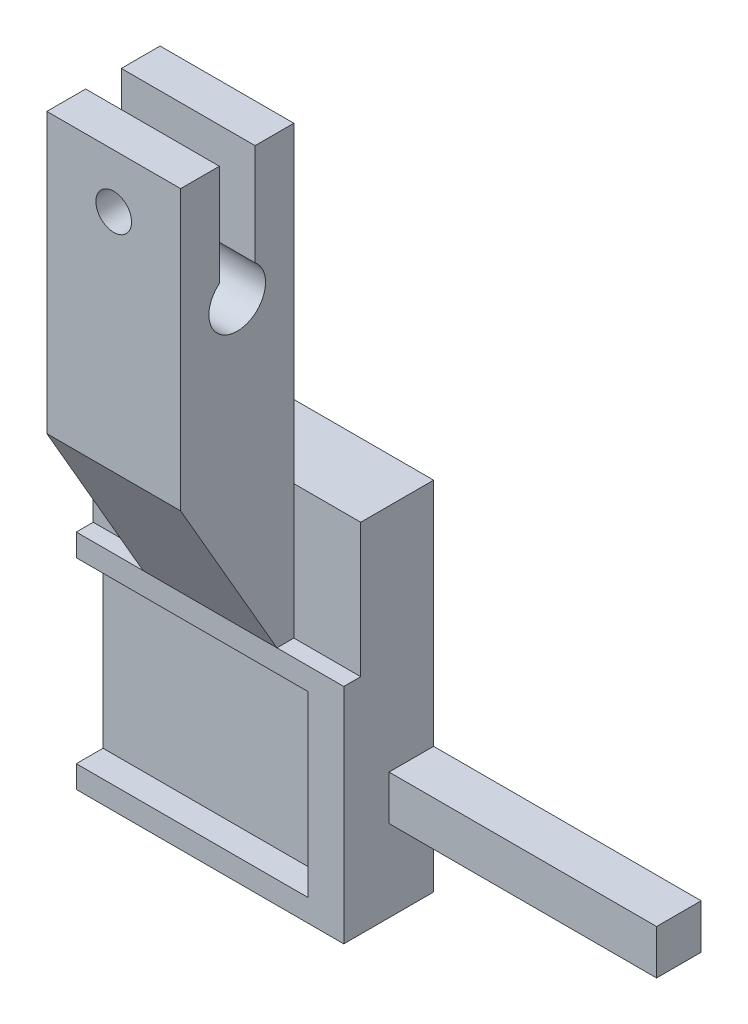
ISO-10303-21;
HEADER;
FILE_DESCRIPTION(('STEP AP214'),'2;1');
FILE_NAME('part.step','',(''),(''),'','','');
FILE_SCHEMA(('AUTOMOTIVE_DESIGN { 1 0 10303 214 1 1 1 1 }'));
ENDSEC;
DATA;
#1=APPLICATION_CONTEXT('core data for automotive mechanical design processes');
#2=APPLICATION_PROTOCOL_DEFINITION('international standard','automotive_design',2000,#1);
#3=PRODUCT_CONTEXT('',#1,'mechanical');
#4=PRODUCT('Part','Part','',(#3));
#5=PRODUCT_RELATED_PRODUCT_CATEGORY('part','',(#4));
#6=PRODUCT_DEFINITION_FORMATION('','',#4);
#7=PRODUCT_DEFINITION_CONTEXT('part definition',#1,'design');
#8=PRODUCT_DEFINITION('design','',#6,#7);
#9=PRODUCT_DEFINITION_SHAPE('','',#8);
#10=(LENGTH_UNIT() NAMED_UNIT(*) SI_UNIT(.MILLI.,.METRE.));
#11=(NAMED_UNIT(*) PLANE_ANGLE_UNIT() SI_UNIT($,.RADIAN.));
#12=(NAMED_UNIT(*) SI_UNIT($,.STERADIAN.) SOLID_ANGLE_UNIT());
#13=UNCERTAINTY_MEASURE_WITH_UNIT(LENGTH_MEASURE(1.E-05),#10,'distance_accuracy_value','');
#14=(GEOMETRIC_REPRESENTATION_CONTEXT(3) GLOBAL_UNCERTAINTY_ASSIGNED_CONTEXT((#13)) GLOBAL_UNIT_ASSIGNED_CONTEXT((#10,
#11,#12)) REPRESENTATION_CONTEXT('',''));
#15=CARTESIAN_POINT('',(0.,0.,0.));
#16=DIRECTION('',(0.,0.,1.));
#17=DIRECTION('',(1.,0.,0.));
#18=AXIS2_PLACEMENT_3D('',#15,#16,#17);
#19=CARTESIAN_POINT('',(15.,25.,8.17500000000001));
#20=DIRECTION('',(0.,0.,-1.));
#21=DIRECTION('',(0.,1.,0.));
#22=AXIS2_PLACEMENT_3D('',#19,#20,#21);
#23=PLANE('',#22);
#24=DIRECTION('',(0.,-1.,0.));
#25=VECTOR('',#24,1.);
#26=CARTESIAN_POINT('',(-7.5,40.,8.17500000000001));
#27=LINE('',#26,#25);
#28=CARTESIAN_POINT('',(-7.5,40.,8.17500000000001));
#29=VERTEX_POINT('',#28);
#30=CARTESIAN_POINT('',(-7.5,25.,8.175));
#31=VERTEX_POINT('',#30);
#32=EDGE_CURVE('E351',#29,#31,#27,.T.);
#33=ORIENTED_EDGE('',*,*,#32,.T.);
#34=DIRECTION('',(1.,0.,0.));
#35=VECTOR('',#34,1.);
#36=CARTESIAN_POINT('',(15.,25.,8.17500000000001));
#37=LINE('',#36,#35);
#38=CARTESIAN_POINT('',(0.,25.,8.17500000000001));
#39=VERTEX_POINT('',#38);
#40=EDGE_CURVE('E229',#31,#39,#37,.T.);
#41=ORIENTED_EDGE('',*,*,#40,.T.);
#42=DIRECTION('',(0.,-1.,0.));
#43=VECTOR('',#42,1.);
#44=CARTESIAN_POINT('',(0.,0.,8.175));
#45=LINE('',#44,#43);
#46=CARTESIAN_POINT('',(0.,40.,8.17500000000001));
#47=VERTEX_POINT('',#46);
#48=EDGE_CURVE('E11',#47,#39,#45,.T.);
#49=ORIENTED_EDGE('',*,*,#48,.F.);
#50=DIRECTION('',(1.,0.,0.));
#51=VECTOR('',#50,1.);
#52=CARTESIAN_POINT('',(-7.5,40.,8.17500000000001));
#53=LINE('',#52,#51);
#54=EDGE_CURVE('E340',#29,#47,#53,.T.);
#55=ORIENTED_EDGE('',*,*,#54,.F.);
#56=EDGE_LOOP('',(#33,#41,#49,#55));
#57=FACE_BOUND('',#56,.T.);
#58=ADVANCED_FACE('F31',(#57),#23,.F.);
#59=DIRECTION('',(0.,-1.,0.));
#60=VECTOR('',#59,1.);
#61=CARTESIAN_POINT('',(15.,0.,8.175));
#62=LINE('',#61,#60);
#63=CARTESIAN_POINT('',(15.,40.,8.17500000000001));
#64=VERTEX_POINT('',#63);
#65=CARTESIAN_POINT('',(15.,25.,8.17500000000001));
#66=VERTEX_POINT('',#65);
#67=EDGE_CURVE('E338',#64,#66,#62,.T.);
#68=ORIENTED_EDGE('',*,*,#67,.T.);
#69=CARTESIAN_POINT('',(22.5,25.,8.175));
#70=VERTEX_POINT('',#69);
#71=EDGE_CURVE('E226',#66,#70,#37,.T.);
#72=ORIENTED_EDGE('',*,*,#71,.T.);
#73=DIRECTION('',(0.,-1.,0.));
#74=VECTOR('',#73,1.);
#75=CARTESIAN_POINT('',(22.5,40.,8.17500000000001));
#76=LINE('',#75,#74);
#77=CARTESIAN_POINT('',(22.5,40.,8.17500000000001));
#78=VERTEX_POINT('',#77);
#79=EDGE_CURVE('E253',#78,#70,#76,.T.);
#80=ORIENTED_EDGE('',*,*,#79,.F.);
#81=EDGE_CURVE('E343',#64,#78,#53,.T.);
#82=ORIENTED_EDGE('',*,*,#81,.F.);
#83=EDGE_LOOP('',(#68,#72,#80,#82));
#84=FACE_BOUND('',#83,.T.);
#85=ADVANCED_FACE('F365',(#84),#23,.F.);
#86=CARTESIAN_POINT('',(15.,75.,8.17500000000001));
#87=DIRECTION('',(0.,-1.,0.));
#88=DIRECTION('',(0.,0.,-1.));
#89=AXIS2_PLACEMENT_3D('',#86,#87,#88);
#90=PLANE('',#89);
#91=DIRECTION('',(0.,0.,1.));
#92=VECTOR('',#91,1.);
#93=CARTESIAN_POINT('',(15.,75.,8.17500000000001));
#94=LINE('',#93,#92);
#95=CARTESIAN_POINT('',(15.,75.,16.525));
#96=VERTEX_POINT('',#95);
#97=CARTESIAN_POINT('',(15.,75.,20.875));
#98=VERTEX_POINT('',#97);
#99=EDGE_CURVE('E304',#96,#98,#94,.T.);
#100=ORIENTED_EDGE('',*,*,#99,.F.);
#101=DIRECTION('',(-1.,0.,0.));
#102=VECTOR('',#101,1.);
#103=CARTESIAN_POINT('',(15.,75.,16.525));
#104=LINE('',#103,#102);
#105=CARTESIAN_POINT('',(0.,75.,16.525));
#106=VERTEX_POINT('',#105);
#107=EDGE_CURVE('E299',#96,#106,#104,.T.);
#108=ORIENTED_EDGE('',*,*,#107,.T.);
#109=DIRECTION('',(0.,0.,1.));
#110=VECTOR('',#109,1.);
#111=CARTESIAN_POINT('',(0.,75.,8.17500000000001));
#112=LINE('',#111,#110);
#113=CARTESIAN_POINT('',(0.,75.,20.875));
#114=VERTEX_POINT('',#113);
#115=EDGE_CURVE('E296',#106,#114,#112,.T.);
#116=ORIENTED_EDGE('',*,*,#115,.T.);
#117=DIRECTION('',(-1.,0.,0.));
#118=VECTOR('',#117,1.);
#119=CARTESIAN_POINT('',(15.,75.,20.875));
#120=LINE('',#119,#118);
#121=EDGE_CURVE('E286',#98,#114,#120,.T.);
#122=ORIENTED_EDGE('',*,*,#121,.F.);
#123=EDGE_LOOP('',(#100,#108,#116,#122));
#124=FACE_BOUND('',#123,.T.);
#125=ADVANCED_FACE('F392',(#124),#90,.F.);
#126=CARTESIAN_POINT('',(15.,0.,8.175));
#127=DIRECTION('',(0.,1.,0.));
#128=DIRECTION('',(0.,0.,1.));
#129=AXIS2_PLACEMENT_3D('',#126,#127,#128);
#130=PLANE('',#129);
#131=DIRECTION('',(-1.,0.,0.));
#132=VECTOR('',#131,1.);
#133=CARTESIAN_POINT('',(22.5,0.,10.075));
#134=LINE('',#133,#132);
#135=CARTESIAN_POINT('',(22.5,0.,10.075));
#136=VERTEX_POINT('',#135);
#137=CARTESIAN_POINT('',(-7.5,0.,10.075));
#138=VERTEX_POINT('',#137);
#139=EDGE_CURVE('E223',#136,#138,#134,.T.);
#140=ORIENTED_EDGE('',*,*,#139,.T.);
#141=DIRECTION('',(0.,0.,-1.));
#142=VECTOR('',#141,1.);
#143=CARTESIAN_POINT('',(-7.5,0.,8.175));
#144=LINE('',#143,#142);
#145=CARTESIAN_POINT('',(-7.5,0.,0.));
#146=VERTEX_POINT('',#145);
#147=EDGE_CURVE('E350',#138,#146,#144,.T.);
#148=ORIENTED_EDGE('',*,*,#147,.T.);
#149=DIRECTION('',(-1.,0.,0.));
#150=VECTOR('',#149,1.);
#151=CARTESIAN_POINT('',(15.,0.,0.));
#152=LINE('',#151,#150);
#153=CARTESIAN_POINT('',(22.5,0.,0.));
#154=VERTEX_POINT('',#153);
#155=EDGE_CURVE('E40',#154,#146,#152,.T.);
#156=ORIENTED_EDGE('',*,*,#155,.F.);
#157=DIRECTION('',(0.,0.,-1.));
#158=VECTOR('',#157,1.);
#159=CARTESIAN_POINT('',(22.5,0.,8.175));
#160=LINE('',#159,#158);
#161=EDGE_CURVE('E258',#136,#154,#160,.T.);
#162=ORIENTED_EDGE('',*,*,#161,.F.);
#163=EDGE_LOOP('',(#140,#148,#156,#162));
#164=FACE_BOUND('',#163,.T.);
#165=ADVANCED_FACE('F33',(#164),#130,.F.);
#166=CARTESIAN_POINT('',(15.,0.,0.));
#167=DIRECTION('',(0.,0.,1.));
#168=DIRECTION('',(1.,0.,0.));
#169=AXIS2_PLACEMENT_3D('',#166,#167,#168);
#170=PLANE('',#169);
#171=ORIENTED_EDGE('',*,*,#155,.T.);
#172=DIRECTION('',(0.,1.,0.));
#173=VECTOR('',#172,1.);
#174=CARTESIAN_POINT('',(-7.5,40.,0.));
#175=LINE('',#174,#173);
#176=CARTESIAN_POINT('',(-7.5,40.,0.));
#177=VERTEX_POINT('',#176);
#178=EDGE_CURVE('E347',#146,#177,#175,.T.);
#179=ORIENTED_EDGE('',*,*,#178,.T.);
#180=DIRECTION('',(-1.,0.,0.));
#181=VECTOR('',#180,1.);
#182=CARTESIAN_POINT('',(15.,40.,0.));
#183=LINE('',#182,#181);
#184=CARTESIAN_POINT('',(22.5,40.,0.));
#185=VERTEX_POINT('',#184);
#186=EDGE_CURVE('E278',#185,#177,#183,.T.);
#187=ORIENTED_EDGE('',*,*,#186,.F.);
#188=DIRECTION('',(0.,1.,0.));
#189=VECTOR('',#188,1.);
#190=CARTESIAN_POINT('',(22.5,40.,0.));
#191=LINE('',#190,#189);
#192=CARTESIAN_POINT('',(22.5,14.15,0.));
#193=VERTEX_POINT('',#192);
#194=EDGE_CURVE('E260',#193,#185,#191,.T.);
#195=ORIENTED_EDGE('',*,*,#194,.F.);
#196=DIRECTION('',(-1.,0.,0.));
#197=VECTOR('',#196,1.);
#198=CARTESIAN_POINT('',(52.5,14.15,0.));
#199=LINE('',#198,#197);
#200=CARTESIAN_POINT('',(52.5,14.15,0.));
#201=VERTEX_POINT('',#200);
#202=EDGE_CURVE('E420',#201,#193,#199,.T.);
#203=ORIENTED_EDGE('',*,*,#202,.F.);
#204=DIRECTION('',(0.,1.,0.));
#205=VECTOR('',#204,1.);
#206=CARTESIAN_POINT('',(52.5,14.15,0.));
#207=LINE('',#206,#205);
#208=CARTESIAN_POINT('',(52.5,9.15,0.));
#209=VERTEX_POINT('',#208);
#210=EDGE_CURVE('E406',#209,#201,#207,.T.);
#211=ORIENTED_EDGE('',*,*,#210,.F.);
#212=DIRECTION('',(-1.,0.,0.));
#213=VECTOR('',#212,1.);
#214=CARTESIAN_POINT('',(52.5,9.15,0.));
#215=LINE('',#214,#213);
#216=CARTESIAN_POINT('',(22.5,9.15,0.));
#217=VERTEX_POINT('',#216);
#218=EDGE_CURVE('E416',#209,#217,#215,.T.);
#219=ORIENTED_EDGE('',*,*,#218,.T.);
#220=EDGE_CURVE('E269',#154,#217,#191,.T.);
#221=ORIENTED_EDGE('',*,*,#220,.F.);
#222=EDGE_LOOP('',(#171,#179,#187,#195,#203,#211,#219,#221));
#223=FACE_BOUND('',#222,.T.);
#224=ADVANCED_FACE('F437',(#223),#170,.F.);
#225=CARTESIAN_POINT('',(15.,40.,0.));
#226=DIRECTION('',(0.,-1.,0.));
#227=DIRECTION('',(0.,0.,-1.));
#228=AXIS2_PLACEMENT_3D('',#225,#226,#227);
#229=PLANE('',#228);
#230=ORIENTED_EDGE('',*,*,#186,.T.);
#231=DIRECTION('',(0.,0.,1.));
#232=VECTOR('',#231,1.);
#233=CARTESIAN_POINT('',(-7.5,40.,8.17500000000001));
#234=LINE('',#233,#232);
#235=EDGE_CURVE('E344',#177,#29,#234,.T.);
#236=ORIENTED_EDGE('',*,*,#235,.T.);
#237=ORIENTED_EDGE('',*,*,#54,.T.);
#238=DIRECTION('',(-1.,0.,0.));
#239=VECTOR('',#238,1.);
#240=CARTESIAN_POINT('',(15.,40.,8.17500000000001));
#241=LINE('',#240,#239);
#242=EDGE_CURVE('E280',#64,#47,#241,.T.);
#243=ORIENTED_EDGE('',*,*,#242,.F.);
#244=ORIENTED_EDGE('',*,*,#81,.T.);
#245=DIRECTION('',(0.,0.,1.));
#246=VECTOR('',#245,1.);
#247=CARTESIAN_POINT('',(22.5,40.,8.17500000000001));
#248=LINE('',#247,#246);
#249=EDGE_CURVE('E263',#185,#78,#248,.T.);
#250=ORIENTED_EDGE('',*,*,#249,.F.);
#251=EDGE_LOOP('',(#230,#236,#237,#243,#244,#250));
#252=FACE_BOUND('',#251,.T.);
#253=ADVANCED_FACE('F369',(#252),#229,.F.);
#254=CARTESIAN_POINT('',(15.,40.,8.17500000000001));
#255=DIRECTION('',(0.,0.,1.));
#256=DIRECTION('',(1.,0.,0.));
#257=AXIS2_PLACEMENT_3D('',#254,#255,#256);
#258=PLANE('',#257);
#259=CARTESIAN_POINT('',(7.5,69.,8.17500000000001));
#260=DIRECTION('',(0.,0.,1.));
#261=DIRECTION('',(1.,0.,0.));
#262=AXIS2_PLACEMENT_3D('',#259,#260,#261);
#263=CIRCLE('',#262,2.);
#264=CARTESIAN_POINT('',(9.5,69.,8.17500000000001));
#265=VERTEX_POINT('',#264);
#266=EDGE_CURVE('E324',#265,#265,#263,.T.);
#267=ORIENTED_EDGE('',*,*,#266,.T.);
#268=EDGE_LOOP('',(#267));
#269=FACE_BOUND('',#268,.T.);
#270=DIRECTION('',(0.,1.,0.));
#271=VECTOR('',#270,1.);
#272=CARTESIAN_POINT('',(0.,40.,8.17500000000001));
#273=LINE('',#272,#271);
#274=CARTESIAN_POINT('',(0.,75.,8.17500000000001));
#275=VERTEX_POINT('',#274);
#276=EDGE_CURVE('E297',#47,#275,#273,.T.);
#277=ORIENTED_EDGE('',*,*,#276,.T.);
#278=DIRECTION('',(-1.,0.,0.));
#279=VECTOR('',#278,1.);
#280=CARTESIAN_POINT('',(15.,75.,8.17500000000001));
#281=LINE('',#280,#279);
#282=CARTESIAN_POINT('',(15.,75.,8.17500000000001));
#283=VERTEX_POINT('',#282);
#284=EDGE_CURVE('E283',#283,#275,#281,.T.);
#285=ORIENTED_EDGE('',*,*,#284,.F.);
#286=DIRECTION('',(0.,1.,0.));
#287=VECTOR('',#286,1.);
#288=CARTESIAN_POINT('',(15.,40.,8.17500000000001));
#289=LINE('',#288,#287);
#290=EDGE_CURVE('E292',#64,#283,#289,.T.);
#291=ORIENTED_EDGE('',*,*,#290,.F.);
#292=ORIENTED_EDGE('',*,*,#242,.T.);
#293=EDGE_LOOP('',(#277,#285,#291,#292));
#294=FACE_BOUND('',#293,.T.);
#295=ADVANCED_FACE('F372',(#269,#294),#258,.F.);
#296=CARTESIAN_POINT('',(0.,75.,12.525));
#297=VERTEX_POINT('',#296);
#298=EDGE_CURVE('E293',#275,#297,#112,.T.);
#299=ORIENTED_EDGE('',*,*,#298,.T.);
#300=DIRECTION('',(-1.,0.,0.));
#301=VECTOR('',#300,1.);
#302=CARTESIAN_POINT('',(15.,75.,12.525));
#303=LINE('',#302,#301);
#304=CARTESIAN_POINT('',(15.,75.,12.525));
#305=VERTEX_POINT('',#304);
#306=EDGE_CURVE('E306',#305,#297,#303,.T.);
#307=ORIENTED_EDGE('',*,*,#306,.F.);
#308=EDGE_CURVE('E301',#283,#305,#94,.T.);
#309=ORIENTED_EDGE('',*,*,#308,.F.);
#310=ORIENTED_EDGE('',*,*,#284,.T.);
#311=EDGE_LOOP('',(#299,#307,#309,#310));
#312=FACE_BOUND('',#311,.T.);
#313=ADVANCED_FACE('F377',(#312),#90,.F.);
#314=CARTESIAN_POINT('',(15.,75.,20.875));
#315=DIRECTION('',(0.,0.,-1.));
#316=DIRECTION('',(0.,1.,0.));
#317=AXIS2_PLACEMENT_3D('',#314,#315,#316);
#318=PLANE('',#317);
#319=CARTESIAN_POINT('',(7.5,69.,20.875));
#320=DIRECTION('',(0.,0.,1.));
#321=DIRECTION('',(1.,0.,0.));
#322=AXIS2_PLACEMENT_3D('',#319,#320,#321);
#323=CIRCLE('',#322,2.);
#324=CARTESIAN_POINT('',(9.5,69.,20.875));
#325=VERTEX_POINT('',#324);
#326=EDGE_CURVE('E275',#325,#325,#323,.T.);
#327=ORIENTED_EDGE('',*,*,#326,.F.);
#328=EDGE_LOOP('',(#327));
#329=FACE_BOUND('',#328,.T.);
#330=DIRECTION('',(0.,-1.,0.));
#331=VECTOR('',#330,1.);
#332=CARTESIAN_POINT('',(0.,75.,20.875));
#333=LINE('',#332,#331);
#334=CARTESIAN_POINT('',(0.,43.7061487217437,20.875));
#335=VERTEX_POINT('',#334);
#336=EDGE_CURVE('E289',#114,#335,#333,.T.);
#337=ORIENTED_EDGE('',*,*,#336,.T.);
#338=DIRECTION('',(1.,0.,0.));
#339=VECTOR('',#338,1.);
#340=CARTESIAN_POINT('',(-7.5,43.7061487217437,20.875));
#341=LINE('',#340,#339);
#342=CARTESIAN_POINT('',(15.,43.7061487217437,20.875));
#343=VERTEX_POINT('',#342);
#344=EDGE_CURVE('E212',#335,#343,#341,.T.);
#345=ORIENTED_EDGE('',*,*,#344,.T.);
#346=DIRECTION('',(0.,-1.,0.));
#347=VECTOR('',#346,1.);
#348=CARTESIAN_POINT('',(15.,75.,20.875));
#349=LINE('',#348,#347);
#350=EDGE_CURVE('E211',#98,#343,#349,.T.);
#351=ORIENTED_EDGE('',*,*,#350,.F.);
#352=ORIENTED_EDGE('',*,*,#121,.T.);
#353=EDGE_LOOP('',(#337,#345,#351,#352));
#354=FACE_BOUND('',#353,.T.);
#355=ADVANCED_FACE('F396',(#329,#354),#318,.F.);
#356=CARTESIAN_POINT('',(15.,0.,0.));
#357=DIRECTION('',(1.,0.,0.));
#358=DIRECTION('',(0.,0.,-1.));
#359=AXIS2_PLACEMENT_3D('',#356,#357,#358);
#360=PLANE('',#359);
#361=DIRECTION('',(0.,0.866025403784436,0.500000000000004));
#362=VECTOR('',#361,1.);
#363=CARTESIAN_POINT('',(15.,25.,10.075));
#364=LINE('',#363,#362);
#365=CARTESIAN_POINT('',(15.,25.,10.075));
#366=VERTEX_POINT('',#365);
#367=EDGE_CURVE('E194',#366,#343,#364,.T.);
#368=ORIENTED_EDGE('',*,*,#367,.F.);
#369=DIRECTION('',(0.,0.,1.));
#370=VECTOR('',#369,1.);
#371=CARTESIAN_POINT('',(15.,25.,0.));
#372=LINE('',#371,#370);
#373=EDGE_CURVE('E208',#66,#366,#372,.T.);
#374=ORIENTED_EDGE('',*,*,#373,.F.);
#375=ORIENTED_EDGE('',*,*,#67,.F.);
#376=ORIENTED_EDGE('',*,*,#290,.T.);
#377=ORIENTED_EDGE('',*,*,#308,.T.);
#378=DIRECTION('',(0.,-1.,0.));
#379=VECTOR('',#378,1.);
#380=CARTESIAN_POINT('',(15.,75.,12.525));
#381=LINE('',#380,#379);
#382=CARTESIAN_POINT('',(15.,63.615892333416,12.525));
#383=VERTEX_POINT('',#382);
#384=EDGE_CURVE('E317',#305,#383,#381,.T.);
#385=ORIENTED_EDGE('',*,*,#384,.T.);
#386=CARTESIAN_POINT('',(15.,61.15,14.525));
#387=DIRECTION('',(-1.,0.,0.));
#388=DIRECTION('',(0.,0.,1.));
#389=AXIS2_PLACEMENT_3D('',#386,#387,#388);
#390=CIRCLE('',#389,3.175);
#391=CARTESIAN_POINT('',(15.,63.615892333416,16.525));
#392=VERTEX_POINT('',#391);
#393=EDGE_CURVE('E327',#383,#392,#390,.T.);
#394=ORIENTED_EDGE('',*,*,#393,.T.);
#395=DIRECTION('',(0.,1.,0.));
#396=VECTOR('',#395,1.);
#397=CARTESIAN_POINT('',(15.,75.,16.525));
#398=LINE('',#397,#396);
#399=EDGE_CURVE('E309',#392,#96,#398,.T.);
#400=ORIENTED_EDGE('',*,*,#399,.T.);
#401=ORIENTED_EDGE('',*,*,#99,.T.);
#402=ORIENTED_EDGE('',*,*,#350,.T.);
#403=EDGE_LOOP('',(#368,#374,#375,#376,#377,#385,#394,#400,#401,#402));
#404=FACE_BOUND('',#403,.T.);
#405=ADVANCED_FACE('F206',(#404),#360,.T.);
#406=CARTESIAN_POINT('',(0.,0.,0.));
#407=DIRECTION('',(1.,0.,0.));
#408=DIRECTION('',(0.,0.,-1.));
#409=AXIS2_PLACEMENT_3D('',#406,#407,#408);
#410=PLANE('',#409);
#411=DIRECTION('',(0.,0.,1.));
#412=VECTOR('',#411,1.);
#413=CARTESIAN_POINT('',(0.,25.,0.));
#414=LINE('',#413,#412);
#415=CARTESIAN_POINT('',(0.,25.,10.075));
#416=VERTEX_POINT('',#415);
#417=EDGE_CURVE('E227',#39,#416,#414,.T.);
#418=ORIENTED_EDGE('',*,*,#417,.T.);
#419=DIRECTION('',(0.,0.866025403784436,0.500000000000004));
#420=VECTOR('',#419,1.);
#421=CARTESIAN_POINT('',(0.,1.88739702843597,-3.26906754730559));
#422=LINE('',#421,#420);
#423=EDGE_CURVE('E197',#416,#335,#422,.T.);
#424=ORIENTED_EDGE('',*,*,#423,.T.);
#425=ORIENTED_EDGE('',*,*,#336,.F.);
#426=ORIENTED_EDGE('',*,*,#115,.F.);
#427=DIRECTION('',(0.,1.,0.));
#428=VECTOR('',#427,1.);
#429=CARTESIAN_POINT('',(0.,75.,16.525));
#430=LINE('',#429,#428);
#431=CARTESIAN_POINT('',(0.,63.615892333416,16.525));
#432=VERTEX_POINT('',#431);
#433=EDGE_CURVE('E315',#432,#106,#430,.T.);
#434=ORIENTED_EDGE('',*,*,#433,.F.);
#435=CARTESIAN_POINT('',(0.,61.15,14.525));
#436=DIRECTION('',(-1.,0.,0.));
#437=DIRECTION('',(0.,0.,1.));
#438=AXIS2_PLACEMENT_3D('',#435,#436,#437);
#439=CIRCLE('',#438,3.175);
#440=CARTESIAN_POINT('',(0.,63.615892333416,12.525));
#441=VERTEX_POINT('',#440);
#442=EDGE_CURVE('E318',#441,#432,#439,.T.);
#443=ORIENTED_EDGE('',*,*,#442,.F.);
#444=DIRECTION('',(0.,-1.,0.));
#445=VECTOR('',#444,1.);
#446=CARTESIAN_POINT('',(0.,75.,12.525));
#447=LINE('',#446,#445);
#448=EDGE_CURVE('E321',#297,#441,#447,.T.);
#449=ORIENTED_EDGE('',*,*,#448,.F.);
#450=ORIENTED_EDGE('',*,*,#298,.F.);
#451=ORIENTED_EDGE('',*,*,#276,.F.);
#452=ORIENTED_EDGE('',*,*,#48,.T.);
#453=EDGE_LOOP('',(#418,#424,#425,#426,#434,#443,#449,#450,#451,#452));
#454=FACE_BOUND('',#453,.T.);
#455=ADVANCED_FACE('F506',(#454),#410,.F.);
#456=CARTESIAN_POINT('',(15.,75.,16.525));
#457=DIRECTION('',(0.,0.,1.));
#458=DIRECTION('',(1.,0.,0.));
#459=AXIS2_PLACEMENT_3D('',#456,#457,#458);
#460=PLANE('',#459);
#461=CARTESIAN_POINT('',(7.5,69.,16.525));
#462=DIRECTION('',(0.,0.,1.));
#463=DIRECTION('',(1.,0.,0.));
#464=AXIS2_PLACEMENT_3D('',#461,#462,#463);
#465=CIRCLE('',#464,2.);
#466=CARTESIAN_POINT('',(9.5,69.,16.525));
#467=VERTEX_POINT('',#466);
#468=EDGE_CURVE('E274',#467,#467,#465,.T.);
#469=ORIENTED_EDGE('',*,*,#468,.T.);
#470=EDGE_LOOP('',(#469));
#471=FACE_BOUND('',#470,.T.);
#472=ORIENTED_EDGE('',*,*,#433,.T.);
#473=ORIENTED_EDGE('',*,*,#107,.F.);
#474=ORIENTED_EDGE('',*,*,#399,.F.);
#475=DIRECTION('',(-1.,0.,0.));
#476=VECTOR('',#475,1.);
#477=CARTESIAN_POINT('',(15.,63.615892333416,16.525));
#478=LINE('',#477,#476);
#479=EDGE_CURVE('E311',#392,#432,#478,.T.);
#480=ORIENTED_EDGE('',*,*,#479,.T.);
#481=EDGE_LOOP('',(#472,#473,#474,#480));
#482=FACE_BOUND('',#481,.T.);
#483=ADVANCED_FACE('F388',(#471,#482),#460,.F.);
#484=CARTESIAN_POINT('',(15.,61.15,14.525));
#485=DIRECTION('',(-1.,0.,0.));
#486=DIRECTION('',(0.,0.,1.));
#487=AXIS2_PLACEMENT_3D('',#484,#485,#486);
#488=CYLINDRICAL_SURFACE('',#487,3.175);
#489=ORIENTED_EDGE('',*,*,#442,.T.);
#490=ORIENTED_EDGE('',*,*,#479,.F.);
#491=ORIENTED_EDGE('',*,*,#393,.F.);
#492=DIRECTION('',(-1.,0.,0.));
#493=VECTOR('',#492,1.);
#494=CARTESIAN_POINT('',(15.,63.615892333416,12.525));
#495=LINE('',#494,#493);
#496=EDGE_CURVE('E308',#383,#441,#495,.T.);
#497=ORIENTED_EDGE('',*,*,#496,.T.);
#498=EDGE_LOOP('',(#489,#490,#491,#497));
#499=FACE_BOUND('',#498,.T.);
#500=ADVANCED_FACE('F384',(#499),#488,.F.);
#501=CARTESIAN_POINT('',(15.,75.,12.525));
#502=DIRECTION('',(0.,0.,-1.));
#503=DIRECTION('',(0.,1.,0.));
#504=AXIS2_PLACEMENT_3D('',#501,#502,#503);
#505=PLANE('',#504);
#506=CARTESIAN_POINT('',(7.5,69.,12.525));
#507=DIRECTION('',(0.,0.,-1.));
#508=DIRECTION('',(0.,1.,0.));
#509=AXIS2_PLACEMENT_3D('',#506,#507,#508);
#510=CIRCLE('',#509,2.);
#511=CARTESIAN_POINT('',(7.5,71.,12.525));
#512=VERTEX_POINT('',#511);
#513=EDGE_CURVE('E271',#512,#512,#510,.T.);
#514=ORIENTED_EDGE('',*,*,#513,.T.);
#515=EDGE_LOOP('',(#514));
#516=FACE_BOUND('',#515,.T.);
#517=ORIENTED_EDGE('',*,*,#448,.T.);
#518=ORIENTED_EDGE('',*,*,#496,.F.);
#519=ORIENTED_EDGE('',*,*,#384,.F.);
#520=ORIENTED_EDGE('',*,*,#306,.T.);
#521=EDGE_LOOP('',(#517,#518,#519,#520));
#522=FACE_BOUND('',#521,.T.);
#523=ADVANCED_FACE('F380',(#516,#522),#505,.F.);
#524=CARTESIAN_POINT('',(7.5,69.,0.));
#525=DIRECTION('',(0.,0.,1.));
#526=DIRECTION('',(1.,0.,0.));
#527=AXIS2_PLACEMENT_3D('',#524,#525,#526);
#528=CYLINDRICAL_SURFACE('',#527,2.);
#529=ORIENTED_EDGE('',*,*,#513,.F.);
#530=EDGE_LOOP('',(#529));
#531=FACE_BOUND('',#530,.T.);
#532=ORIENTED_EDGE('',*,*,#266,.F.);
#533=EDGE_LOOP('',(#532));
#534=FACE_BOUND('',#533,.T.);
#535=ADVANCED_FACE('F692',(#531,#534),#528,.F.);
#536=ORIENTED_EDGE('',*,*,#326,.T.);
#537=EDGE_LOOP('',(#536));
#538=FACE_BOUND('',#537,.T.);
#539=ORIENTED_EDGE('',*,*,#468,.F.);
#540=EDGE_LOOP('',(#539));
#541=FACE_BOUND('',#540,.T.);
#542=ADVANCED_FACE('F700',(#538,#541),#528,.F.);
#543=CARTESIAN_POINT('',(-7.5,0.,8.175));
#544=DIRECTION('',(1.,0.,0.));
#545=DIRECTION('',(0.,0.,-1.));
#546=AXIS2_PLACEMENT_3D('',#543,#544,#545);
#547=PLANE('',#546);
#548=ORIENTED_EDGE('',*,*,#178,.F.);
#549=ORIENTED_EDGE('',*,*,#147,.F.);
#550=DIRECTION('',(0.,1.,0.));
#551=VECTOR('',#550,1.);
#552=CARTESIAN_POINT('',(-7.5,0.,10.075));
#553=LINE('',#552,#551);
#554=CARTESIAN_POINT('',(-7.5,2.5,10.075));
#555=VERTEX_POINT('',#554);
#556=EDGE_CURVE('E453',#138,#555,#553,.T.);
#557=ORIENTED_EDGE('',*,*,#556,.T.);
#558=DIRECTION('',(0.,0.,1.));
#559=VECTOR('',#558,1.);
#560=CARTESIAN_POINT('',(-7.5,2.5,7.07500000000001));
#561=LINE('',#560,#559);
#562=CARTESIAN_POINT('',(-7.5,2.5,7.07500000000001));
#563=VERTEX_POINT('',#562);
#564=EDGE_CURVE('E246',#563,#555,#561,.T.);
#565=ORIENTED_EDGE('',*,*,#564,.F.);
#566=DIRECTION('',(0.,-1.,0.));
#567=VECTOR('',#566,1.);
#568=CARTESIAN_POINT('',(-7.5,22.5,7.075));
#569=LINE('',#568,#567);
#570=CARTESIAN_POINT('',(-7.5,22.5,7.075));
#571=VERTEX_POINT('',#570);
#572=EDGE_CURVE('E244',#571,#563,#569,.T.);
#573=ORIENTED_EDGE('',*,*,#572,.F.);
#574=DIRECTION('',(0.,0.,-1.));
#575=VECTOR('',#574,1.);
#576=CARTESIAN_POINT('',(-7.5,22.5,7.075));
#577=LINE('',#576,#575);
#578=CARTESIAN_POINT('',(-7.5,22.5,10.075));
#579=VERTEX_POINT('',#578);
#580=EDGE_CURVE('E238',#579,#571,#577,.T.);
#581=ORIENTED_EDGE('',*,*,#580,.F.);
#582=DIRECTION('',(0.,1.,0.));
#583=VECTOR('',#582,1.);
#584=CARTESIAN_POINT('',(-7.5,22.5,10.075));
#585=LINE('',#584,#583);
#586=CARTESIAN_POINT('',(-7.5,25.,10.075));
#587=VERTEX_POINT('',#586);
#588=EDGE_CURVE('E450',#579,#587,#585,.T.);
#589=ORIENTED_EDGE('',*,*,#588,.T.);
#590=DIRECTION('',(0.,0.,-1.));
#591=VECTOR('',#590,1.);
#592=CARTESIAN_POINT('',(-7.5,25.,10.075));
#593=LINE('',#592,#591);
#594=EDGE_CURVE('E447',#587,#31,#593,.T.);
#595=ORIENTED_EDGE('',*,*,#594,.T.);
#596=ORIENTED_EDGE('',*,*,#32,.F.);
#597=ORIENTED_EDGE('',*,*,#235,.F.);
#598=EDGE_LOOP('',(#548,#549,#557,#565,#573,#581,#589,#595,#596,#597));
#599=FACE_BOUND('',#598,.T.);
#600=ADVANCED_FACE('F442',(#599),#547,.F.);
#601=CARTESIAN_POINT('',(22.5,0.,8.175));
#602=DIRECTION('',(1.,0.,0.));
#603=DIRECTION('',(0.,0.,-1.));
#604=AXIS2_PLACEMENT_3D('',#601,#602,#603);
#605=PLANE('',#604);
#606=DIRECTION('',(0.,0.,1.));
#607=VECTOR('',#606,1.);
#608=CARTESIAN_POINT('',(22.5,14.15,5.00000000000001));
#609=LINE('',#608,#607);
#610=CARTESIAN_POINT('',(22.5,14.15,5.00000000000001));
#611=VERTEX_POINT('',#610);
#612=EDGE_CURVE('E404',#193,#611,#609,.T.);
#613=ORIENTED_EDGE('',*,*,#612,.F.);
#614=ORIENTED_EDGE('',*,*,#194,.T.);
#615=ORIENTED_EDGE('',*,*,#249,.T.);
#616=ORIENTED_EDGE('',*,*,#79,.T.);
#617=DIRECTION('',(0.,0.,-1.));
#618=VECTOR('',#617,1.);
#619=CARTESIAN_POINT('',(22.5,25.,10.075));
#620=LINE('',#619,#618);
#621=CARTESIAN_POINT('',(22.5,25.,10.075));
#622=VERTEX_POINT('',#621);
#623=EDGE_CURVE('E456',#622,#70,#620,.T.);
#624=ORIENTED_EDGE('',*,*,#623,.F.);
#625=DIRECTION('',(0.,1.,0.));
#626=VECTOR('',#625,1.);
#627=CARTESIAN_POINT('',(22.5,0.,10.075));
#628=LINE('',#627,#626);
#629=EDGE_CURVE('E219',#136,#622,#628,.T.);
#630=ORIENTED_EDGE('',*,*,#629,.F.);
#631=ORIENTED_EDGE('',*,*,#161,.T.);
#632=ORIENTED_EDGE('',*,*,#220,.T.);
#633=DIRECTION('',(0.,0.,-1.));
#634=VECTOR('',#633,1.);
#635=CARTESIAN_POINT('',(22.5,9.15,5.00000000000001));
#636=LINE('',#635,#634);
#637=CARTESIAN_POINT('',(22.5,9.15,5.00000000000001));
#638=VERTEX_POINT('',#637);
#639=EDGE_CURVE('E53',#638,#217,#636,.T.);
#640=ORIENTED_EDGE('',*,*,#639,.F.);
#641=DIRECTION('',(0.,-1.,0.));
#642=VECTOR('',#641,1.);
#643=CARTESIAN_POINT('',(22.5,14.15,5.00000000000001));
#644=LINE('',#643,#642);
#645=EDGE_CURVE('E48',#611,#638,#644,.T.);
#646=ORIENTED_EDGE('',*,*,#645,.F.);
#647=EDGE_LOOP('',(#613,#614,#615,#616,#624,#630,#631,#632,#640,#646));
#648=FACE_BOUND('',#647,.T.);
#649=ADVANCED_FACE('F359',(#648),#605,.T.);
#650=CARTESIAN_POINT('',(18.5,22.5,7.075));
#651=DIRECTION('',(0.,0.,-1.));
#652=DIRECTION('',(0.,1.,0.));
#653=AXIS2_PLACEMENT_3D('',#650,#651,#652);
#654=PLANE('',#653);
#655=ORIENTED_EDGE('',*,*,#572,.T.);
#656=DIRECTION('',(-1.,0.,0.));
#657=VECTOR('',#656,1.);
#658=CARTESIAN_POINT('',(18.5,2.5,7.07500000000001));
#659=LINE('',#658,#657);
#660=CARTESIAN_POINT('',(18.5,2.5,7.07500000000001));
#661=VERTEX_POINT('',#660);
#662=EDGE_CURVE('E243',#661,#563,#659,.T.);
#663=ORIENTED_EDGE('',*,*,#662,.F.);
#664=DIRECTION('',(0.,-1.,0.));
#665=VECTOR('',#664,1.);
#666=CARTESIAN_POINT('',(18.5,22.5,7.075));
#667=LINE('',#666,#665);
#668=CARTESIAN_POINT('',(18.5,22.5,7.075));
#669=VERTEX_POINT('',#668);
#670=EDGE_CURVE('E234',#669,#661,#667,.T.);
#671=ORIENTED_EDGE('',*,*,#670,.F.);
#672=DIRECTION('',(-1.,0.,0.));
#673=VECTOR('',#672,1.);
#674=CARTESIAN_POINT('',(18.5,22.5,7.075));
#675=LINE('',#674,#673);
#676=EDGE_CURVE('E251',#669,#571,#675,.T.);
#677=ORIENTED_EDGE('',*,*,#676,.T.);
#678=EDGE_LOOP('',(#655,#663,#671,#677));
#679=FACE_BOUND('',#678,.T.);
#680=ADVANCED_FACE('F486',(#679),#654,.F.);
#681=CARTESIAN_POINT('',(18.5,22.5,7.075));
#682=DIRECTION('',(0.,1.,0.));
#683=DIRECTION('',(0.,0.,1.));
#684=AXIS2_PLACEMENT_3D('',#681,#682,#683);
#685=PLANE('',#684);
#686=DIRECTION('',(0.,0.,-1.));
#687=VECTOR('',#686,1.);
#688=CARTESIAN_POINT('',(18.5,22.5,7.075));
#689=LINE('',#688,#687);
#690=CARTESIAN_POINT('',(18.5,22.5,10.075));
#691=VERTEX_POINT('',#690);
#692=EDGE_CURVE('E240',#691,#669,#689,.T.);
#693=ORIENTED_EDGE('',*,*,#692,.F.);
#694=DIRECTION('',(-1.,0.,0.));
#695=VECTOR('',#694,1.);
#696=CARTESIAN_POINT('',(22.5,22.5,10.075));
#697=LINE('',#696,#695);
#698=EDGE_CURVE('E464',#691,#579,#697,.T.);
#699=ORIENTED_EDGE('',*,*,#698,.T.);
#700=ORIENTED_EDGE('',*,*,#580,.T.);
#701=ORIENTED_EDGE('',*,*,#676,.F.);
#702=EDGE_LOOP('',(#693,#699,#700,#701));
#703=FACE_BOUND('',#702,.T.);
#704=ADVANCED_FACE('F488',(#703),#685,.F.);
#705=CARTESIAN_POINT('',(18.5,2.5,7.07500000000001));
#706=DIRECTION('',(0.,-1.,0.));
#707=DIRECTION('',(0.,0.,-1.));
#708=AXIS2_PLACEMENT_3D('',#705,#706,#707);
#709=PLANE('',#708);
#710=DIRECTION('',(-1.,0.,0.));
#711=VECTOR('',#710,1.);
#712=CARTESIAN_POINT('',(22.5,2.5,10.075));
#713=LINE('',#712,#711);
#714=CARTESIAN_POINT('',(18.5,2.5,10.075));
#715=VERTEX_POINT('',#714);
#716=EDGE_CURVE('E231',#715,#555,#713,.T.);
#717=ORIENTED_EDGE('',*,*,#716,.F.);
#718=DIRECTION('',(0.,0.,1.));
#719=VECTOR('',#718,1.);
#720=CARTESIAN_POINT('',(18.5,2.5,7.07500000000001));
#721=LINE('',#720,#719);
#722=EDGE_CURVE('E237',#661,#715,#721,.T.);
#723=ORIENTED_EDGE('',*,*,#722,.F.);
#724=ORIENTED_EDGE('',*,*,#662,.T.);
#725=ORIENTED_EDGE('',*,*,#564,.T.);
#726=EDGE_LOOP('',(#717,#723,#724,#725));
#727=FACE_BOUND('',#726,.T.);
#728=ADVANCED_FACE('F483',(#727),#709,.F.);
#729=CARTESIAN_POINT('',(18.5,2.5,7.07500000000001));
#730=DIRECTION('',(-1.,0.,0.));
#731=DIRECTION('',(0.,0.,1.));
#732=AXIS2_PLACEMENT_3D('',#729,#730,#731);
#733=PLANE('',#732);
#734=ORIENTED_EDGE('',*,*,#670,.T.);
#735=ORIENTED_EDGE('',*,*,#722,.T.);
#736=DIRECTION('',(0.,-1.,0.));
#737=VECTOR('',#736,1.);
#738=CARTESIAN_POINT('',(18.5,25.,10.075));
#739=LINE('',#738,#737);
#740=EDGE_CURVE('E458',#691,#715,#739,.T.);
#741=ORIENTED_EDGE('',*,*,#740,.F.);
#742=ORIENTED_EDGE('',*,*,#692,.T.);
#743=EDGE_LOOP('',(#734,#735,#741,#742));
#744=FACE_BOUND('',#743,.T.);
#745=ADVANCED_FACE('F495',(#744),#733,.T.);
#746=CARTESIAN_POINT('',(22.5,25.,10.075));
#747=DIRECTION('',(0.,1.,0.));
#748=DIRECTION('',(0.,0.,1.));
#749=AXIS2_PLACEMENT_3D('',#746,#747,#748);
#750=PLANE('',#749);
#751=ORIENTED_EDGE('',*,*,#40,.F.);
#752=ORIENTED_EDGE('',*,*,#594,.F.);
#753=DIRECTION('',(-1.,0.,0.));
#754=VECTOR('',#753,1.);
#755=CARTESIAN_POINT('',(22.5,25.,10.075));
#756=LINE('',#755,#754);
#757=EDGE_CURVE('E202',#416,#587,#756,.T.);
#758=ORIENTED_EDGE('',*,*,#757,.F.);
#759=ORIENTED_EDGE('',*,*,#417,.F.);
#760=EDGE_LOOP('',(#751,#752,#758,#759));
#761=FACE_BOUND('',#760,.T.);
#762=ADVANCED_FACE('F565',(#761),#750,.T.);
#763=ORIENTED_EDGE('',*,*,#373,.T.);
#764=EDGE_CURVE('E201',#622,#366,#756,.T.);
#765=ORIENTED_EDGE('',*,*,#764,.F.);
#766=ORIENTED_EDGE('',*,*,#623,.T.);
#767=ORIENTED_EDGE('',*,*,#71,.F.);
#768=EDGE_LOOP('',(#763,#765,#766,#767));
#769=FACE_BOUND('',#768,.T.);
#770=ADVANCED_FACE('F225',(#769),#750,.T.);
#771=CARTESIAN_POINT('',(22.5,0.,10.075));
#772=DIRECTION('',(0.,0.,1.));
#773=DIRECTION('',(1.,0.,0.));
#774=AXIS2_PLACEMENT_3D('',#771,#772,#773);
#775=PLANE('',#774);
#776=ORIENTED_EDGE('',*,*,#556,.F.);
#777=ORIENTED_EDGE('',*,*,#139,.F.);
#778=ORIENTED_EDGE('',*,*,#629,.T.);
#779=ORIENTED_EDGE('',*,*,#764,.T.);
#780=EDGE_CURVE('E191',#366,#416,#756,.T.);
#781=ORIENTED_EDGE('',*,*,#780,.T.);
#782=ORIENTED_EDGE('',*,*,#757,.T.);
#783=ORIENTED_EDGE('',*,*,#588,.F.);
#784=ORIENTED_EDGE('',*,*,#698,.F.);
#785=ORIENTED_EDGE('',*,*,#740,.T.);
#786=ORIENTED_EDGE('',*,*,#716,.T.);
#787=EDGE_LOOP('',(#776,#777,#778,#779,#781,#782,#783,#784,#785,#786));
#788=FACE_BOUND('',#787,.T.);
#789=ADVANCED_FACE('F216',(#788),#775,.T.);
#790=CARTESIAN_POINT('',(52.5,14.15,5.00000000000001));
#791=DIRECTION('',(0.,0.,-1.));
#792=DIRECTION('',(0.,1.,0.));
#793=AXIS2_PLACEMENT_3D('',#790,#791,#792);
#794=PLANE('',#793);
#795=ORIENTED_EDGE('',*,*,#645,.T.);
#796=DIRECTION('',(-1.,0.,0.));
#797=VECTOR('',#796,1.);
#798=CARTESIAN_POINT('',(52.5,9.15,5.00000000000001));
#799=LINE('',#798,#797);
#800=CARTESIAN_POINT('',(52.5,9.15,5.00000000000001));
#801=VERTEX_POINT('',#800);
#802=EDGE_CURVE('E419',#801,#638,#799,.T.);
#803=ORIENTED_EDGE('',*,*,#802,.F.);
#804=DIRECTION('',(0.,-1.,0.));
#805=VECTOR('',#804,1.);
#806=CARTESIAN_POINT('',(52.5,14.15,5.00000000000001));
#807=LINE('',#806,#805);
#808=CARTESIAN_POINT('',(52.5,14.15,5.00000000000001));
#809=VERTEX_POINT('',#808);
#810=EDGE_CURVE('E400',#809,#801,#807,.T.);
#811=ORIENTED_EDGE('',*,*,#810,.F.);
#812=DIRECTION('',(-1.,0.,0.));
#813=VECTOR('',#812,1.);
#814=CARTESIAN_POINT('',(52.5,14.15,5.00000000000001));
#815=LINE('',#814,#813);
#816=EDGE_CURVE('E410',#809,#611,#815,.T.);
#817=ORIENTED_EDGE('',*,*,#816,.T.);
#818=EDGE_LOOP('',(#795,#803,#811,#817));
#819=FACE_BOUND('',#818,.T.);
#820=ADVANCED_FACE('F433',(#819),#794,.F.);
#821=CARTESIAN_POINT('',(52.5,9.15,5.00000000000001));
#822=DIRECTION('',(0.,1.,0.));
#823=DIRECTION('',(0.,0.,1.));
#824=AXIS2_PLACEMENT_3D('',#821,#822,#823);
#825=PLANE('',#824);
#826=ORIENTED_EDGE('',*,*,#639,.T.);
#827=ORIENTED_EDGE('',*,*,#218,.F.);
#828=DIRECTION('',(0.,0.,-1.));
#829=VECTOR('',#828,1.);
#830=CARTESIAN_POINT('',(52.5,9.15,5.00000000000001));
#831=LINE('',#830,#829);
#832=EDGE_CURVE('E403',#801,#209,#831,.T.);
#833=ORIENTED_EDGE('',*,*,#832,.F.);
#834=ORIENTED_EDGE('',*,*,#802,.T.);
#835=EDGE_LOOP('',(#826,#827,#833,#834));
#836=FACE_BOUND('',#835,.T.);
#837=ADVANCED_FACE('F471',(#836),#825,.F.);
#838=CARTESIAN_POINT('',(52.5,14.15,5.00000000000001));
#839=DIRECTION('',(0.,-1.,0.));
#840=DIRECTION('',(0.,0.,-1.));
#841=AXIS2_PLACEMENT_3D('',#838,#839,#840);
#842=PLANE('',#841);
#843=ORIENTED_EDGE('',*,*,#612,.T.);
#844=ORIENTED_EDGE('',*,*,#816,.F.);
#845=DIRECTION('',(0.,0.,1.));
#846=VECTOR('',#845,1.);
#847=CARTESIAN_POINT('',(52.5,14.15,5.00000000000001));
#848=LINE('',#847,#846);
#849=EDGE_CURVE('E408',#201,#809,#848,.T.);
#850=ORIENTED_EDGE('',*,*,#849,.F.);
#851=ORIENTED_EDGE('',*,*,#202,.T.);
#852=EDGE_LOOP('',(#843,#844,#850,#851));
#853=FACE_BOUND('',#852,.T.);
#854=ADVANCED_FACE('F435',(#853),#842,.F.);
#855=CARTESIAN_POINT('',(52.5,9.15,5.00000000000001));
#856=DIRECTION('',(1.,0.,0.));
#857=DIRECTION('',(0.,0.,-1.));
#858=AXIS2_PLACEMENT_3D('',#855,#856,#857);
#859=PLANE('',#858);
#860=ORIENTED_EDGE('',*,*,#810,.T.);
#861=ORIENTED_EDGE('',*,*,#832,.T.);
#862=ORIENTED_EDGE('',*,*,#210,.T.);
#863=ORIENTED_EDGE('',*,*,#849,.T.);
#864=EDGE_LOOP('',(#860,#861,#862,#863));
#865=FACE_BOUND('',#864,.T.);
#866=ADVANCED_FACE('F474',(#865),#859,.T.);
#867=CARTESIAN_POINT('',(-7.5,25.,10.075));
#868=DIRECTION('',(0.,0.500000000000004,-0.866025403784436));
#869=DIRECTION('',(0.,0.866025403784436,0.500000000000004));
#870=AXIS2_PLACEMENT_3D('',#867,#868,#869);
#871=PLANE('',#870);
#872=ORIENTED_EDGE('',*,*,#780,.F.);
#873=ORIENTED_EDGE('',*,*,#367,.T.);
#874=ORIENTED_EDGE('',*,*,#344,.F.);
#875=ORIENTED_EDGE('',*,*,#423,.F.);
#876=EDGE_LOOP('',(#872,#873,#874,#875));
#877=FACE_BOUND('',#876,.T.);
#878=ADVANCED_FACE('F193',(#877),#871,.F.);
#879=CLOSED_SHELL('',(#58,#85,#125,#165,#224,#253,#295,#313,#355,#405,#455,#483,#500,#523,#535,
#542,#600,#649,#680,#704,#728,#745,#762,#770,#789,#820,#837,#854,#866,#878));
#880=MANIFOLD_SOLID_BREP('B2',#879);
#881=ADVANCED_BREP_SHAPE_REPRESENTATION('',(#18,#880),#14);
#882=SHAPE_DEFINITION_REPRESENTATION(#9,#881);
ENDSEC;
END-ISO-10303-21;
